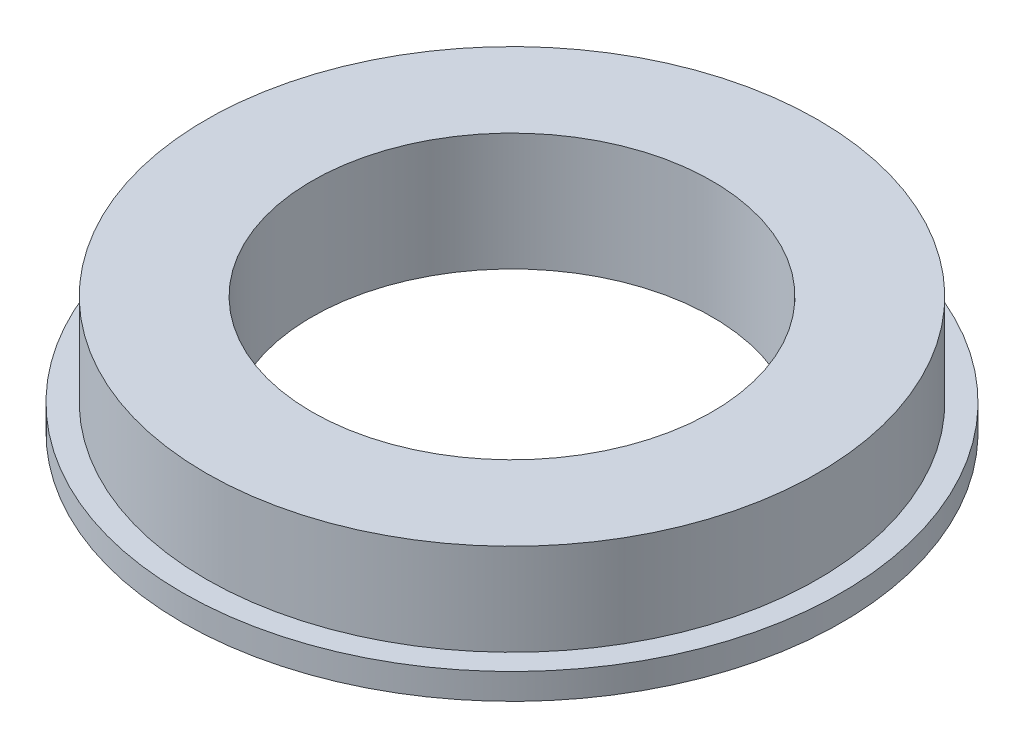
ISO-10303-21;
HEADER;
FILE_DESCRIPTION(('STEP AP214'),'2;1');
FILE_NAME('part.step','',(''),(''),'','','');
FILE_SCHEMA(('AUTOMOTIVE_DESIGN { 1 0 10303 214 1 1 1 1 }'));
ENDSEC;
DATA;
#1=APPLICATION_CONTEXT('core data for automotive mechanical design processes');
#2=APPLICATION_PROTOCOL_DEFINITION('international standard','automotive_design',2000,#1);
#3=PRODUCT_CONTEXT('',#1,'mechanical');
#4=PRODUCT('Part','Part','',(#3));
#5=PRODUCT_RELATED_PRODUCT_CATEGORY('part','',(#4));
#6=PRODUCT_DEFINITION_FORMATION('','',#4);
#7=PRODUCT_DEFINITION_CONTEXT('part definition',#1,'design');
#8=PRODUCT_DEFINITION('design','',#6,#7);
#9=PRODUCT_DEFINITION_SHAPE('','',#8);
#10=(LENGTH_UNIT() NAMED_UNIT(*) SI_UNIT(.MILLI.,.METRE.));
#11=(NAMED_UNIT(*) PLANE_ANGLE_UNIT() SI_UNIT($,.RADIAN.));
#12=(NAMED_UNIT(*) SI_UNIT($,.STERADIAN.) SOLID_ANGLE_UNIT());
#13=UNCERTAINTY_MEASURE_WITH_UNIT(LENGTH_MEASURE(1.E-05),#10,'distance_accuracy_value','');
#14=(GEOMETRIC_REPRESENTATION_CONTEXT(3) GLOBAL_UNCERTAINTY_ASSIGNED_CONTEXT((#13)) GLOBAL_UNIT_ASSIGNED_CONTEXT((#10,
#11,#12)) REPRESENTATION_CONTEXT('',''));
#15=CARTESIAN_POINT('',(0.,0.,0.));
#16=DIRECTION('',(0.,0.,1.));
#17=DIRECTION('',(1.,0.,0.));
#18=AXIS2_PLACEMENT_3D('',#15,#16,#17);
#19=CARTESIAN_POINT('',(0.,1.1,0.));
#20=DIRECTION('',(0.,-1.,0.));
#21=DIRECTION('',(0.,0.,-1.));
#22=AXIS2_PLACEMENT_3D('',#19,#20,#21);
#23=CYLINDRICAL_SURFACE('',#22,14.);
#24=CARTESIAN_POINT('',(0.,1.1,0.));
#25=DIRECTION('',(0.,1.,0.));
#26=DIRECTION('',(0.,0.,1.));
#27=AXIS2_PLACEMENT_3D('',#24,#25,#26);
#28=CIRCLE('',#27,14.);
#29=CARTESIAN_POINT('',(0.,1.1,14.));
#30=VERTEX_POINT('',#29);
#31=EDGE_CURVE('E41',#30,#30,#28,.T.);
#32=ORIENTED_EDGE('',*,*,#31,.F.);
#33=EDGE_LOOP('',(#32));
#34=FACE_BOUND('',#33,.T.);
#35=CARTESIAN_POINT('',(0.,0.,0.));
#36=DIRECTION('',(0.,1.,0.));
#37=DIRECTION('',(0.,0.,1.));
#38=AXIS2_PLACEMENT_3D('',#35,#36,#37);
#39=CIRCLE('',#38,14.);
#40=CARTESIAN_POINT('',(0.,0.,14.));
#41=VERTEX_POINT('',#40);
#42=EDGE_CURVE('E37',#41,#41,#39,.T.);
#43=ORIENTED_EDGE('',*,*,#42,.T.);
#44=EDGE_LOOP('',(#43));
#45=FACE_BOUND('',#44,.T.);
#46=ADVANCED_FACE('F34',(#34,#45),#23,.T.);
#47=CARTESIAN_POINT('',(0.,1.1,0.));
#48=DIRECTION('',(0.,1.,0.));
#49=DIRECTION('',(0.,0.,1.));
#50=AXIS2_PLACEMENT_3D('',#47,#48,#49);
#51=PLANE('',#50);
#52=CARTESIAN_POINT('',(0.,1.1,0.));
#53=DIRECTION('',(0.,1.,0.));
#54=DIRECTION('',(0.,0.,1.));
#55=AXIS2_PLACEMENT_3D('',#52,#53,#54);
#56=CIRCLE('',#55,13.);
#57=CARTESIAN_POINT('',(0.,1.1,13.));
#58=VERTEX_POINT('',#57);
#59=EDGE_CURVE('E10',#58,#58,#56,.T.);
#60=ORIENTED_EDGE('',*,*,#59,.F.);
#61=EDGE_LOOP('',(#60));
#62=FACE_BOUND('',#61,.T.);
#63=ORIENTED_EDGE('',*,*,#31,.T.);
#64=EDGE_LOOP('',(#63));
#65=FACE_BOUND('',#64,.T.);
#66=ADVANCED_FACE('F78',(#62,#65),#51,.T.);
#67=CARTESIAN_POINT('',(0.,0.,0.));
#68=DIRECTION('',(0.,1.,0.));
#69=DIRECTION('',(0.,0.,1.));
#70=AXIS2_PLACEMENT_3D('',#67,#68,#69);
#71=PLANE('',#70);
#72=CARTESIAN_POINT('',(0.,0.,0.));
#73=DIRECTION('',(0.,1.,0.));
#74=DIRECTION('',(0.,0.,1.));
#75=AXIS2_PLACEMENT_3D('',#72,#73,#74);
#76=CIRCLE('',#75,8.5);
#77=CARTESIAN_POINT('',(0.,0.,8.5));
#78=VERTEX_POINT('',#77);
#79=EDGE_CURVE('E50',#78,#78,#76,.T.);
#80=ORIENTED_EDGE('',*,*,#79,.T.);
#81=EDGE_LOOP('',(#80));
#82=FACE_BOUND('',#81,.T.);
#83=ORIENTED_EDGE('',*,*,#42,.F.);
#84=EDGE_LOOP('',(#83));
#85=FACE_BOUND('',#84,.T.);
#86=ADVANCED_FACE('F57',(#82,#85),#71,.F.);
#87=CARTESIAN_POINT('',(0.,5.,0.));
#88=DIRECTION('',(0.,-1.,0.));
#89=DIRECTION('',(0.,0.,-1.));
#90=AXIS2_PLACEMENT_3D('',#87,#88,#89);
#91=CYLINDRICAL_SURFACE('',#90,13.);
#92=CARTESIAN_POINT('',(0.,5.,0.));
#93=DIRECTION('',(0.,1.,0.));
#94=DIRECTION('',(0.,0.,1.));
#95=AXIS2_PLACEMENT_3D('',#92,#93,#94);
#96=CIRCLE('',#95,13.);
#97=CARTESIAN_POINT('',(0.,5.,13.));
#98=VERTEX_POINT('',#97);
#99=EDGE_CURVE('E47',#98,#98,#96,.T.);
#100=ORIENTED_EDGE('',*,*,#99,.F.);
#101=EDGE_LOOP('',(#100));
#102=FACE_BOUND('',#101,.T.);
#103=ORIENTED_EDGE('',*,*,#59,.T.);
#104=EDGE_LOOP('',(#103));
#105=FACE_BOUND('',#104,.T.);
#106=ADVANCED_FACE('F69',(#102,#105),#91,.T.);
#107=CARTESIAN_POINT('',(0.,5.,0.));
#108=DIRECTION('',(0.,1.,0.));
#109=DIRECTION('',(0.,0.,1.));
#110=AXIS2_PLACEMENT_3D('',#107,#108,#109);
#111=PLANE('',#110);
#112=CARTESIAN_POINT('',(0.,5.,0.));
#113=DIRECTION('',(0.,1.,0.));
#114=DIRECTION('',(0.,0.,1.));
#115=AXIS2_PLACEMENT_3D('',#112,#113,#114);
#116=CIRCLE('',#115,8.5);
#117=CARTESIAN_POINT('',(0.,5.,8.5));
#118=VERTEX_POINT('',#117);
#119=EDGE_CURVE('E51',#118,#118,#116,.T.);
#120=ORIENTED_EDGE('',*,*,#119,.F.);
#121=EDGE_LOOP('',(#120));
#122=FACE_BOUND('',#121,.T.);
#123=ORIENTED_EDGE('',*,*,#99,.T.);
#124=EDGE_LOOP('',(#123));
#125=FACE_BOUND('',#124,.T.);
#126=ADVANCED_FACE('F63',(#122,#125),#111,.T.);
#127=CARTESIAN_POINT('',(0.,0.,0.));
#128=DIRECTION('',(0.,1.,0.));
#129=DIRECTION('',(0.,0.,1.));
#130=AXIS2_PLACEMENT_3D('',#127,#128,#129);
#131=CYLINDRICAL_SURFACE('',#130,8.5);
#132=ORIENTED_EDGE('',*,*,#79,.F.);
#133=EDGE_LOOP('',(#132));
#134=FACE_BOUND('',#133,.T.);
#135=ORIENTED_EDGE('',*,*,#119,.T.);
#136=EDGE_LOOP('',(#135));
#137=FACE_BOUND('',#136,.T.);
#138=ADVANCED_FACE('F60',(#134,#137),#131,.F.);
#139=CLOSED_SHELL('',(#46,#66,#86,#106,#126,#138));
#140=MANIFOLD_SOLID_BREP('B2',#139);
#141=ADVANCED_BREP_SHAPE_REPRESENTATION('',(#18,#140),#14);
#142=SHAPE_DEFINITION_REPRESENTATION(#9,#141);
ENDSEC;
END-ISO-10303-21;
